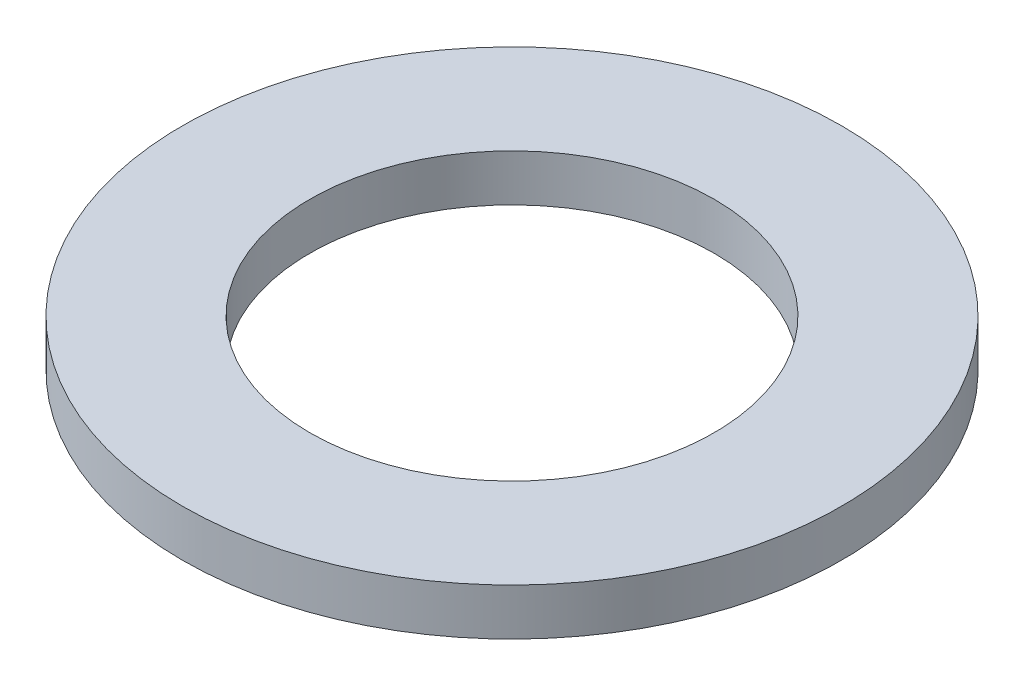
ISO-10303-21;
HEADER;
FILE_DESCRIPTION(('STEP AP214'),'2;1');
FILE_NAME('part.step','',(''),(''),'','','');
FILE_SCHEMA(('AUTOMOTIVE_DESIGN { 1 0 10303 214 1 1 1 1 }'));
ENDSEC;
DATA;
#1=APPLICATION_CONTEXT('core data for automotive mechanical design processes');
#2=APPLICATION_PROTOCOL_DEFINITION('international standard','automotive_design',2000,#1);
#3=PRODUCT_CONTEXT('',#1,'mechanical');
#4=PRODUCT('Part','Part','',(#3));
#5=PRODUCT_RELATED_PRODUCT_CATEGORY('part','',(#4));
#6=PRODUCT_DEFINITION_FORMATION('','',#4);
#7=PRODUCT_DEFINITION_CONTEXT('part definition',#1,'design');
#8=PRODUCT_DEFINITION('design','',#6,#7);
#9=PRODUCT_DEFINITION_SHAPE('','',#8);
#10=(LENGTH_UNIT() NAMED_UNIT(*) SI_UNIT(.MILLI.,.METRE.));
#11=(NAMED_UNIT(*) PLANE_ANGLE_UNIT() SI_UNIT($,.RADIAN.));
#12=(NAMED_UNIT(*) SI_UNIT($,.STERADIAN.) SOLID_ANGLE_UNIT());
#13=UNCERTAINTY_MEASURE_WITH_UNIT(LENGTH_MEASURE(1.E-05),#10,'distance_accuracy_value','');
#14=(GEOMETRIC_REPRESENTATION_CONTEXT(3) GLOBAL_UNCERTAINTY_ASSIGNED_CONTEXT((#13)) GLOBAL_UNIT_ASSIGNED_CONTEXT((#10,
#11,#12)) REPRESENTATION_CONTEXT('',''));
#15=CARTESIAN_POINT('',(0.,0.,0.));
#16=DIRECTION('',(0.,0.,1.));
#17=DIRECTION('',(1.,0.,0.));
#18=AXIS2_PLACEMENT_3D('',#15,#16,#17);
#19=CARTESIAN_POINT('',(0.,0.79375,0.));
#20=DIRECTION('',(0.,1.,0.));
#21=DIRECTION('',(0.,0.,1.));
#22=AXIS2_PLACEMENT_3D('',#19,#20,#21);
#23=PLANE('',#22);
#24=CARTESIAN_POINT('',(0.,0.79375,0.));
#25=DIRECTION('',(0.,1.,0.));
#26=DIRECTION('',(0.,0.,1.));
#27=AXIS2_PLACEMENT_3D('',#24,#25,#26);
#28=CIRCLE('',#27,5.588);
#29=CARTESIAN_POINT('',(0.,0.79375,5.588));
#30=VERTEX_POINT('',#29);
#31=EDGE_CURVE('E10',#30,#30,#28,.T.);
#32=ORIENTED_EDGE('',*,*,#31,.T.);
#33=EDGE_LOOP('',(#32));
#34=FACE_BOUND('',#33,.T.);
#35=CARTESIAN_POINT('',(0.,0.79375,0.));
#36=DIRECTION('',(0.,1.,0.));
#37=DIRECTION('',(0.,0.,1.));
#38=AXIS2_PLACEMENT_3D('',#35,#36,#37);
#39=CIRCLE('',#38,3.429);
#40=CARTESIAN_POINT('',(0.,0.79375,3.429));
#41=VERTEX_POINT('',#40);
#42=EDGE_CURVE('E58',#41,#41,#39,.T.);
#43=ORIENTED_EDGE('',*,*,#42,.F.);
#44=EDGE_LOOP('',(#43));
#45=FACE_BOUND('',#44,.T.);
#46=ADVANCED_FACE('F45',(#34,#45),#23,.T.);
#47=CARTESIAN_POINT('',(0.,0.,0.));
#48=DIRECTION('',(0.,1.,0.));
#49=DIRECTION('',(0.,0.,1.));
#50=AXIS2_PLACEMENT_3D('',#47,#48,#49);
#51=PLANE('',#50);
#52=CARTESIAN_POINT('',(0.,0.,0.));
#53=DIRECTION('',(0.,1.,0.));
#54=DIRECTION('',(0.,0.,1.));
#55=AXIS2_PLACEMENT_3D('',#52,#53,#54);
#56=CIRCLE('',#55,5.588);
#57=CARTESIAN_POINT('',(0.,0.,5.588));
#58=VERTEX_POINT('',#57);
#59=EDGE_CURVE('E49',#58,#58,#56,.T.);
#60=ORIENTED_EDGE('',*,*,#59,.F.);
#61=EDGE_LOOP('',(#60));
#62=FACE_BOUND('',#61,.T.);
#63=CARTESIAN_POINT('',(0.,0.,0.));
#64=DIRECTION('',(0.,1.,0.));
#65=DIRECTION('',(0.,0.,1.));
#66=AXIS2_PLACEMENT_3D('',#63,#64,#65);
#67=CIRCLE('',#66,3.429);
#68=CARTESIAN_POINT('',(0.,0.,3.429));
#69=VERTEX_POINT('',#68);
#70=EDGE_CURVE('E60',#69,#69,#67,.T.);
#71=ORIENTED_EDGE('',*,*,#70,.T.);
#72=EDGE_LOOP('',(#71));
#73=FACE_BOUND('',#72,.T.);
#74=ADVANCED_FACE('F72',(#62,#73),#51,.F.);
#75=CARTESIAN_POINT('',(0.,0.79375,0.));
#76=DIRECTION('',(0.,-1.,0.));
#77=DIRECTION('',(0.,0.,-1.));
#78=AXIS2_PLACEMENT_3D('',#75,#76,#77);
#79=CYLINDRICAL_SURFACE('',#78,5.588);
#80=ORIENTED_EDGE('',*,*,#31,.F.);
#81=EDGE_LOOP('',(#80));
#82=FACE_BOUND('',#81,.T.);
#83=ORIENTED_EDGE('',*,*,#59,.T.);
#84=EDGE_LOOP('',(#83));
#85=FACE_BOUND('',#84,.T.);
#86=ADVANCED_FACE('F47',(#82,#85),#79,.T.);
#87=CARTESIAN_POINT('',(0.,0.79375,0.));
#88=DIRECTION('',(0.,-1.,0.));
#89=DIRECTION('',(0.,0.,-1.));
#90=AXIS2_PLACEMENT_3D('',#87,#88,#89);
#91=CYLINDRICAL_SURFACE('',#90,3.429);
#92=ORIENTED_EDGE('',*,*,#42,.T.);
#93=EDGE_LOOP('',(#92));
#94=FACE_BOUND('',#93,.T.);
#95=ORIENTED_EDGE('',*,*,#70,.F.);
#96=EDGE_LOOP('',(#95));
#97=FACE_BOUND('',#96,.T.);
#98=ADVANCED_FACE('F68',(#94,#97),#91,.F.);
#99=CLOSED_SHELL('',(#46,#74,#86,#98));
#100=MANIFOLD_SOLID_BREP('B2',#99);
#101=ADVANCED_BREP_SHAPE_REPRESENTATION('',(#18,#100),#14);
#102=SHAPE_DEFINITION_REPRESENTATION(#9,#101);
ENDSEC;
END-ISO-10303-21;
